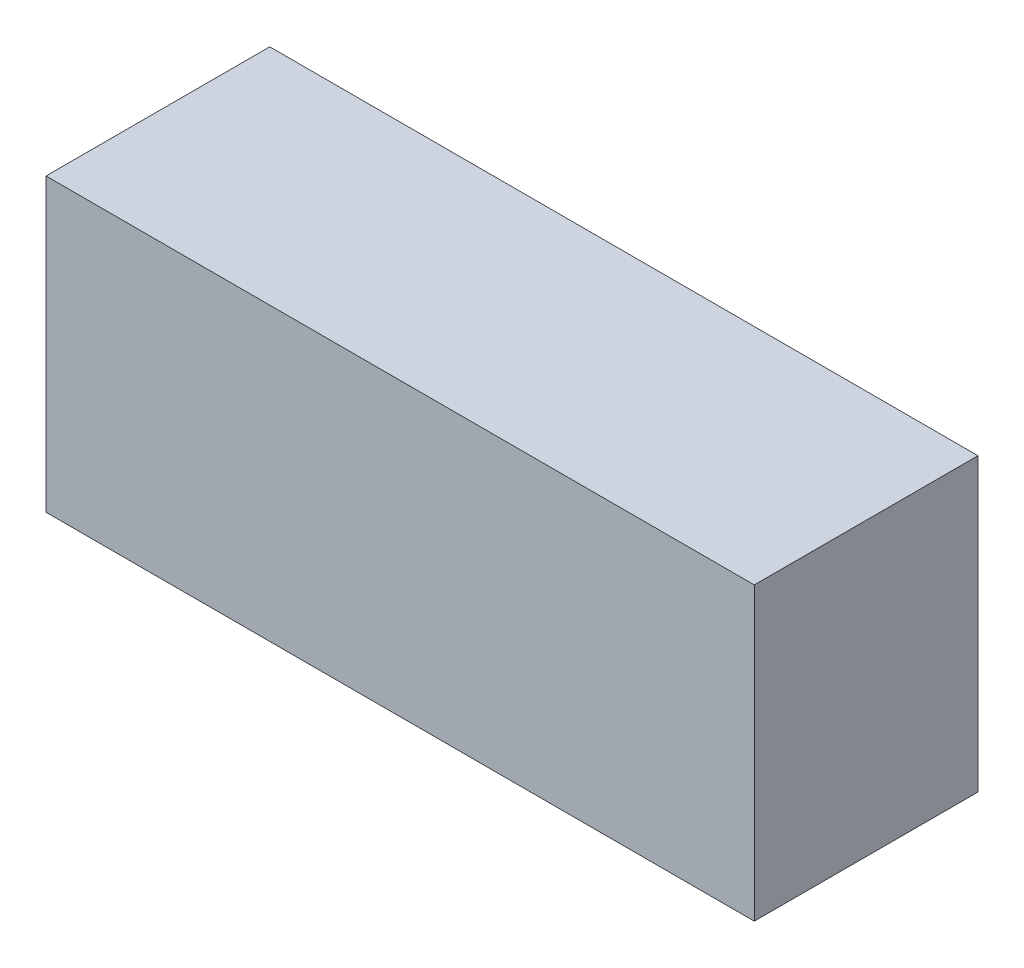
ISO-10303-21;
HEADER;
FILE_DESCRIPTION(('STEP AP214'),'2;1');
FILE_NAME('part.step','',(''),(''),'','','');
FILE_SCHEMA(('AUTOMOTIVE_DESIGN { 1 0 10303 214 1 1 1 1 }'));
ENDSEC;
DATA;
#1=APPLICATION_CONTEXT('core data for automotive mechanical design processes');
#2=APPLICATION_PROTOCOL_DEFINITION('international standard','automotive_design',2000,#1);
#3=PRODUCT_CONTEXT('',#1,'mechanical');
#4=PRODUCT('Part','Part','',(#3));
#5=PRODUCT_RELATED_PRODUCT_CATEGORY('part','',(#4));
#6=PRODUCT_DEFINITION_FORMATION('','',#4);
#7=PRODUCT_DEFINITION_CONTEXT('part definition',#1,'design');
#8=PRODUCT_DEFINITION('design','',#6,#7);
#9=PRODUCT_DEFINITION_SHAPE('','',#8);
#10=(LENGTH_UNIT() NAMED_UNIT(*) SI_UNIT(.MILLI.,.METRE.));
#11=(NAMED_UNIT(*) PLANE_ANGLE_UNIT() SI_UNIT($,.RADIAN.));
#12=(NAMED_UNIT(*) SI_UNIT($,.STERADIAN.) SOLID_ANGLE_UNIT());
#13=UNCERTAINTY_MEASURE_WITH_UNIT(LENGTH_MEASURE(1.E-05),#10,'distance_accuracy_value','');
#14=(GEOMETRIC_REPRESENTATION_CONTEXT(3) GLOBAL_UNCERTAINTY_ASSIGNED_CONTEXT((#13)) GLOBAL_UNIT_ASSIGNED_CONTEXT((#10,
#11,#12)) REPRESENTATION_CONTEXT('',''));
#15=CARTESIAN_POINT('',(0.,0.,0.));
#16=DIRECTION('',(0.,0.,1.));
#17=DIRECTION('',(1.,0.,0.));
#18=AXIS2_PLACEMENT_3D('',#15,#16,#17);
#19=CARTESIAN_POINT('',(67.945,55.88,-21.463));
#20=DIRECTION('',(-1.,0.,0.));
#21=DIRECTION('',(0.,0.,1.));
#22=AXIS2_PLACEMENT_3D('',#19,#20,#21);
#23=PLANE('',#22);
#24=DIRECTION('',(0.,0.,-1.));
#25=VECTOR('',#24,1.);
#26=CARTESIAN_POINT('',(67.945,0.,-21.463));
#27=LINE('',#26,#25);
#28=CARTESIAN_POINT('',(67.945,0.,21.463));
#29=VERTEX_POINT('',#28);
#30=CARTESIAN_POINT('',(67.945,0.,-21.463));
#31=VERTEX_POINT('',#30);
#32=EDGE_CURVE('E96',#29,#31,#27,.T.);
#33=ORIENTED_EDGE('',*,*,#32,.T.);
#34=DIRECTION('',(0.,-1.,0.));
#35=VECTOR('',#34,1.);
#36=CARTESIAN_POINT('',(67.945,55.88,-21.463));
#37=LINE('',#36,#35);
#38=CARTESIAN_POINT('',(67.945,55.88,-21.463));
#39=VERTEX_POINT('',#38);
#40=EDGE_CURVE('E11',#39,#31,#37,.T.);
#41=ORIENTED_EDGE('',*,*,#40,.F.);
#42=DIRECTION('',(0.,0.,-1.));
#43=VECTOR('',#42,1.);
#44=CARTESIAN_POINT('',(67.945,55.88,-21.463));
#45=LINE('',#44,#43);
#46=CARTESIAN_POINT('',(67.945,55.88,21.463));
#47=VERTEX_POINT('',#46);
#48=EDGE_CURVE('E84',#47,#39,#45,.T.);
#49=ORIENTED_EDGE('',*,*,#48,.F.);
#50=DIRECTION('',(0.,-1.,0.));
#51=VECTOR('',#50,1.);
#52=CARTESIAN_POINT('',(67.945,55.88,21.463));
#53=LINE('',#52,#51);
#54=EDGE_CURVE('E92',#47,#29,#53,.T.);
#55=ORIENTED_EDGE('',*,*,#54,.T.);
#56=EDGE_LOOP('',(#33,#41,#49,#55));
#57=FACE_BOUND('',#56,.T.);
#58=ADVANCED_FACE('F33',(#57),#23,.F.);
#59=CARTESIAN_POINT('',(-67.945,55.88,-21.463));
#60=DIRECTION('',(0.,0.,1.));
#61=DIRECTION('',(1.,0.,0.));
#62=AXIS2_PLACEMENT_3D('',#59,#60,#61);
#63=PLANE('',#62);
#64=DIRECTION('',(-1.,0.,0.));
#65=VECTOR('',#64,1.);
#66=CARTESIAN_POINT('',(-67.945,0.,-21.463));
#67=LINE('',#66,#65);
#68=CARTESIAN_POINT('',(-67.945,0.,-21.463));
#69=VERTEX_POINT('',#68);
#70=EDGE_CURVE('E88',#31,#69,#67,.T.);
#71=ORIENTED_EDGE('',*,*,#70,.T.);
#72=DIRECTION('',(0.,-1.,0.));
#73=VECTOR('',#72,1.);
#74=CARTESIAN_POINT('',(-67.945,55.88,-21.463));
#75=LINE('',#74,#73);
#76=CARTESIAN_POINT('',(-67.945,55.88,-21.463));
#77=VERTEX_POINT('',#76);
#78=EDGE_CURVE('E41',#77,#69,#75,.T.);
#79=ORIENTED_EDGE('',*,*,#78,.F.);
#80=DIRECTION('',(-1.,0.,0.));
#81=VECTOR('',#80,1.);
#82=CARTESIAN_POINT('',(-67.945,55.88,-21.463));
#83=LINE('',#82,#81);
#84=EDGE_CURVE('E79',#39,#77,#83,.T.);
#85=ORIENTED_EDGE('',*,*,#84,.F.);
#86=ORIENTED_EDGE('',*,*,#40,.T.);
#87=EDGE_LOOP('',(#71,#79,#85,#86));
#88=FACE_BOUND('',#87,.T.);
#89=ADVANCED_FACE('F87',(#88),#63,.F.);
#90=CARTESIAN_POINT('',(-67.945,55.88,-21.463));
#91=DIRECTION('',(1.,0.,0.));
#92=DIRECTION('',(0.,0.,-1.));
#93=AXIS2_PLACEMENT_3D('',#90,#91,#92);
#94=PLANE('',#93);
#95=DIRECTION('',(0.,0.,1.));
#96=VECTOR('',#95,1.);
#97=CARTESIAN_POINT('',(-67.945,0.,-21.463));
#98=LINE('',#97,#96);
#99=CARTESIAN_POINT('',(-67.945,0.,21.463));
#100=VERTEX_POINT('',#99);
#101=EDGE_CURVE('E66',#69,#100,#98,.T.);
#102=ORIENTED_EDGE('',*,*,#101,.T.);
#103=DIRECTION('',(0.,-1.,0.));
#104=VECTOR('',#103,1.);
#105=CARTESIAN_POINT('',(-67.945,55.88,21.463));
#106=LINE('',#105,#104);
#107=CARTESIAN_POINT('',(-67.945,55.88,21.463));
#108=VERTEX_POINT('',#107);
#109=EDGE_CURVE('E89',#108,#100,#106,.T.);
#110=ORIENTED_EDGE('',*,*,#109,.F.);
#111=DIRECTION('',(0.,0.,1.));
#112=VECTOR('',#111,1.);
#113=CARTESIAN_POINT('',(-67.945,55.88,-21.463));
#114=LINE('',#113,#112);
#115=EDGE_CURVE('E82',#77,#108,#114,.T.);
#116=ORIENTED_EDGE('',*,*,#115,.F.);
#117=ORIENTED_EDGE('',*,*,#78,.T.);
#118=EDGE_LOOP('',(#102,#110,#116,#117));
#119=FACE_BOUND('',#118,.T.);
#120=ADVANCED_FACE('F90',(#119),#94,.F.);
#121=CARTESIAN_POINT('',(-67.945,55.88,21.463));
#122=DIRECTION('',(0.,0.,-1.));
#123=DIRECTION('',(-1.,0.,0.));
#124=AXIS2_PLACEMENT_3D('',#121,#122,#123);
#125=PLANE('',#124);
#126=DIRECTION('',(1.,0.,0.));
#127=VECTOR('',#126,1.);
#128=CARTESIAN_POINT('',(-67.945,0.,21.463));
#129=LINE('',#128,#127);
#130=EDGE_CURVE('E72',#100,#29,#129,.T.);
#131=ORIENTED_EDGE('',*,*,#130,.T.);
#132=ORIENTED_EDGE('',*,*,#54,.F.);
#133=DIRECTION('',(1.,0.,0.));
#134=VECTOR('',#133,1.);
#135=CARTESIAN_POINT('',(-67.945,55.88,21.463));
#136=LINE('',#135,#134);
#137=EDGE_CURVE('E49',#108,#47,#136,.T.);
#138=ORIENTED_EDGE('',*,*,#137,.F.);
#139=ORIENTED_EDGE('',*,*,#109,.T.);
#140=EDGE_LOOP('',(#131,#132,#138,#139));
#141=FACE_BOUND('',#140,.T.);
#142=ADVANCED_FACE('F103',(#141),#125,.F.);
#143=CARTESIAN_POINT('',(67.945,55.88,21.463));
#144=DIRECTION('',(0.,1.,0.));
#145=DIRECTION('',(0.,0.,1.));
#146=AXIS2_PLACEMENT_3D('',#143,#144,#145);
#147=PLANE('',#146);
#148=ORIENTED_EDGE('',*,*,#48,.T.);
#149=ORIENTED_EDGE('',*,*,#84,.T.);
#150=ORIENTED_EDGE('',*,*,#115,.T.);
#151=ORIENTED_EDGE('',*,*,#137,.T.);
#152=EDGE_LOOP('',(#148,#149,#150,#151));
#153=FACE_BOUND('',#152,.T.);
#154=ADVANCED_FACE('F80',(#153),#147,.T.);
#155=CARTESIAN_POINT('',(67.945,0.,21.463));
#156=DIRECTION('',(0.,1.,0.));
#157=DIRECTION('',(0.,0.,1.));
#158=AXIS2_PLACEMENT_3D('',#155,#156,#157);
#159=PLANE('',#158);
#160=ORIENTED_EDGE('',*,*,#32,.F.);
#161=ORIENTED_EDGE('',*,*,#130,.F.);
#162=ORIENTED_EDGE('',*,*,#101,.F.);
#163=ORIENTED_EDGE('',*,*,#70,.F.);
#164=EDGE_LOOP('',(#160,#161,#162,#163));
#165=FACE_BOUND('',#164,.T.);
#166=ADVANCED_FACE('F106',(#165),#159,.F.);
#167=CLOSED_SHELL('',(#58,#89,#120,#142,#154,#166));
#168=MANIFOLD_SOLID_BREP('B2',#167);
#169=ADVANCED_BREP_SHAPE_REPRESENTATION('',(#18,#168),#14);
#170=SHAPE_DEFINITION_REPRESENTATION(#9,#169);
ENDSEC;
END-ISO-10303-21;
